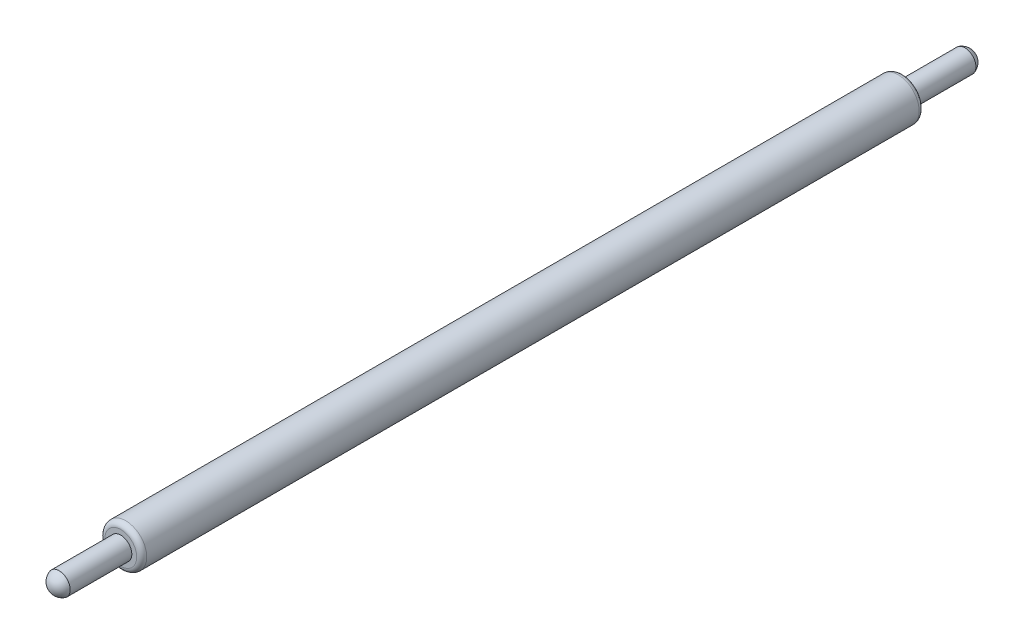
ISO-10303-21;
HEADER;
FILE_DESCRIPTION(('STEP AP214'),'2;1');
FILE_NAME('part.step','',(''),(''),'','','');
FILE_SCHEMA(('AUTOMOTIVE_DESIGN { 1 0 10303 214 1 1 1 1 }'));
ENDSEC;
DATA;
#1=APPLICATION_CONTEXT('core data for automotive mechanical design processes');
#2=APPLICATION_PROTOCOL_DEFINITION('international standard','automotive_design',2000,#1);
#3=PRODUCT_CONTEXT('',#1,'mechanical');
#4=PRODUCT('Part','Part','',(#3));
#5=PRODUCT_RELATED_PRODUCT_CATEGORY('part','',(#4));
#6=PRODUCT_DEFINITION_FORMATION('','',#4);
#7=PRODUCT_DEFINITION_CONTEXT('part definition',#1,'design');
#8=PRODUCT_DEFINITION('design','',#6,#7);
#9=PRODUCT_DEFINITION_SHAPE('','',#8);
#10=(LENGTH_UNIT() NAMED_UNIT(*) SI_UNIT(.MILLI.,.METRE.));
#11=(NAMED_UNIT(*) PLANE_ANGLE_UNIT() SI_UNIT($,.RADIAN.));
#12=(NAMED_UNIT(*) SI_UNIT($,.STERADIAN.) SOLID_ANGLE_UNIT());
#13=UNCERTAINTY_MEASURE_WITH_UNIT(LENGTH_MEASURE(1.E-05),#10,'distance_accuracy_value','');
#14=(GEOMETRIC_REPRESENTATION_CONTEXT(3) GLOBAL_UNCERTAINTY_ASSIGNED_CONTEXT((#13)) GLOBAL_UNIT_ASSIGNED_CONTEXT((#10,
#11,#12)) REPRESENTATION_CONTEXT('',''));
#15=CARTESIAN_POINT('',(0.,0.,0.));
#16=DIRECTION('',(0.,0.,1.));
#17=DIRECTION('',(1.,0.,0.));
#18=AXIS2_PLACEMENT_3D('',#15,#16,#17);
#19=CARTESIAN_POINT('',(0.,0.,13.4303214248775));
#20=DIRECTION('',(0.,0.,-1.));
#21=DIRECTION('',(-1.,0.,0.));
#22=AXIS2_PLACEMENT_3D('',#19,#20,#21);
#23=CYLINDRICAL_SURFACE('',#22,0.625);
#24=CARTESIAN_POINT('',(0.,0.,11.5125544719111));
#25=DIRECTION('',(0.,0.,1.));
#26=DIRECTION('',(0.,-1.,0.));
#27=AXIS2_PLACEMENT_3D('',#24,#25,#26);
#28=CIRCLE('',#27,0.625);
#29=CARTESIAN_POINT('',(0.,-0.625,11.5125544719111));
#30=VERTEX_POINT('',#29);
#31=EDGE_CURVE('E38',#30,#30,#28,.F.);
#32=ORIENTED_EDGE('',*,*,#31,.T.);
#33=EDGE_LOOP('',(#32));
#34=FACE_BOUND('',#33,.T.);
#35=CARTESIAN_POINT('',(0.,0.,-11.5125544719103));
#36=DIRECTION('',(0.,0.,-1.));
#37=DIRECTION('',(0.,1.,0.));
#38=AXIS2_PLACEMENT_3D('',#35,#36,#37);
#39=CIRCLE('',#38,0.625);
#40=CARTESIAN_POINT('',(0.,0.625,-11.5125544719103));
#41=VERTEX_POINT('',#40);
#42=EDGE_CURVE('E42',#41,#41,#39,.F.);
#43=ORIENTED_EDGE('',*,*,#42,.T.);
#44=EDGE_LOOP('',(#43));
#45=FACE_BOUND('',#44,.T.);
#46=ADVANCED_FACE('F31',(#34,#45),#23,.T.);
#47=CARTESIAN_POINT('',(-3.80092958100179,1.95882749862208,11.6625544719111));
#48=DIRECTION('',(0.,0.,1.));
#49=DIRECTION('',(0.,-1.,0.));
#50=AXIS2_PLACEMENT_3D('',#47,#48,#49);
#51=PLANE('',#50);
#52=CARTESIAN_POINT('',(0.,0.,11.6625544719111));
#53=DIRECTION('',(0.,0.,1.));
#54=DIRECTION('',(0.,-1.,0.));
#55=AXIS2_PLACEMENT_3D('',#52,#53,#54);
#56=CIRCLE('',#55,0.475);
#57=CARTESIAN_POINT('',(0.,-0.474999999999998,11.6625544719111));
#58=VERTEX_POINT('',#57);
#59=EDGE_CURVE('E46',#58,#58,#56,.T.);
#60=ORIENTED_EDGE('',*,*,#59,.T.);
#61=EDGE_LOOP('',(#60));
#62=FACE_BOUND('',#61,.T.);
#63=CARTESIAN_POINT('',(0.,0.,11.6625544719111));
#64=DIRECTION('',(0.,0.,1.));
#65=DIRECTION('',(1.,0.,0.));
#66=AXIS2_PLACEMENT_3D('',#63,#64,#65);
#67=CIRCLE('',#66,0.33);
#68=CARTESIAN_POINT('',(0.33,0.,11.6625544719111));
#69=VERTEX_POINT('',#68);
#70=EDGE_CURVE('E58',#69,#69,#67,.T.);
#71=ORIENTED_EDGE('',*,*,#70,.F.);
#72=EDGE_LOOP('',(#71));
#73=FACE_BOUND('',#72,.T.);
#74=ADVANCED_FACE('F70',(#62,#73),#51,.T.);
#75=CARTESIAN_POINT('',(-3.80092958100187,1.95882749862184,-11.6625544719103));
#76=DIRECTION('',(0.,0.,-1.));
#77=DIRECTION('',(0.,1.,0.));
#78=AXIS2_PLACEMENT_3D('',#75,#76,#77);
#79=PLANE('',#78);
#80=CARTESIAN_POINT('',(0.,0.,-11.6625544719103));
#81=DIRECTION('',(0.,0.,-1.));
#82=DIRECTION('',(0.,1.,0.));
#83=AXIS2_PLACEMENT_3D('',#80,#81,#82);
#84=CIRCLE('',#83,0.475);
#85=CARTESIAN_POINT('',(0.,0.474999999999998,-11.6625544719103));
#86=VERTEX_POINT('',#85);
#87=EDGE_CURVE('E10',#86,#86,#84,.T.);
#88=ORIENTED_EDGE('',*,*,#87,.T.);
#89=EDGE_LOOP('',(#88));
#90=FACE_BOUND('',#89,.T.);
#91=CARTESIAN_POINT('',(0.,-1.22158773905749E-13,-11.6625544719103));
#92=DIRECTION('',(0.,0.,-1.));
#93=DIRECTION('',(0.,1.,0.));
#94=AXIS2_PLACEMENT_3D('',#91,#92,#93);
#95=CIRCLE('',#94,0.33);
#96=CARTESIAN_POINT('',(0.,0.329999999999878,-11.6625544719103));
#97=VERTEX_POINT('',#96);
#98=EDGE_CURVE('E51',#97,#97,#95,.T.);
#99=ORIENTED_EDGE('',*,*,#98,.F.);
#100=EDGE_LOOP('',(#99));
#101=FACE_BOUND('',#100,.T.);
#102=ADVANCED_FACE('F67',(#90,#101),#79,.T.);
#103=CARTESIAN_POINT('',(0.,0.,14.4333809511667));
#104=DIRECTION('',(0.,0.,-1.));
#105=DIRECTION('',(-1.,0.,0.));
#106=AXIS2_PLACEMENT_3D('',#103,#104,#105);
#107=CYLINDRICAL_SURFACE('',#106,0.33);
#108=CARTESIAN_POINT('',(0.,0.,13.5000000000004));
#109=DIRECTION('',(0.,0.,-1.));
#110=DIRECTION('',(0.,1.,0.));
#111=AXIS2_PLACEMENT_3D('',#108,#109,#110);
#112=CIRCLE('',#111,0.33);
#113=CARTESIAN_POINT('',(0.,0.33,13.5000000000004));
#114=VERTEX_POINT('',#113);
#115=EDGE_CURVE('E55',#114,#114,#112,.T.);
#116=ORIENTED_EDGE('',*,*,#115,.T.);
#117=EDGE_LOOP('',(#116));
#118=FACE_BOUND('',#117,.T.);
#119=ORIENTED_EDGE('',*,*,#70,.T.);
#120=EDGE_LOOP('',(#119));
#121=FACE_BOUND('',#120,.T.);
#122=ADVANCED_FACE('F69',(#118,#121),#107,.T.);
#123=CARTESIAN_POINT('',(0.,0.,13.4072000000004));
#124=DIRECTION('',(0.,0.,1.));
#125=DIRECTION('',(1.,0.,0.));
#126=AXIS2_PLACEMENT_3D('',#123,#124,#125);
#127=SPHERICAL_SURFACE('',#126,0.3428);
#128=ORIENTED_EDGE('',*,*,#115,.F.);
#129=EDGE_LOOP('',(#128));
#130=FACE_BOUND('',#129,.T.);
#131=ADVANCED_FACE('F76',(#130),#127,.T.);
#132=CARTESIAN_POINT('',(0.,-1.51181640742228E-13,-14.4333809511658));
#133=DIRECTION('',(0.,0.,1.));
#134=DIRECTION('',(0.,-1.,0.));
#135=AXIS2_PLACEMENT_3D('',#132,#133,#134);
#136=CYLINDRICAL_SURFACE('',#135,0.33);
#137=ORIENTED_EDGE('',*,*,#98,.T.);
#138=EDGE_LOOP('',(#137));
#139=FACE_BOUND('',#138,.T.);
#140=CARTESIAN_POINT('',(0.,-1.41404994223142E-13,-13.4999999999996));
#141=DIRECTION('',(0.,0.,-1.));
#142=DIRECTION('',(0.,1.,0.));
#143=AXIS2_PLACEMENT_3D('',#140,#141,#142);
#144=CIRCLE('',#143,0.33);
#145=CARTESIAN_POINT('',(0.,0.329999999999859,-13.4999999999996));
#146=VERTEX_POINT('',#145);
#147=EDGE_CURVE('E52',#146,#146,#144,.T.);
#148=ORIENTED_EDGE('',*,*,#147,.F.);
#149=EDGE_LOOP('',(#148));
#150=FACE_BOUND('',#149,.T.);
#151=ADVANCED_FACE('F64',(#139,#150),#136,.T.);
#152=CARTESIAN_POINT('',(0.,-1.40432965818408E-13,-13.4071999999996));
#153=DIRECTION('',(0.,0.,1.));
#154=DIRECTION('',(1.,0.,0.));
#155=AXIS2_PLACEMENT_3D('',#152,#153,#154);
#156=SPHERICAL_SURFACE('',#155,0.3428);
#157=ORIENTED_EDGE('',*,*,#147,.T.);
#158=EDGE_LOOP('',(#157));
#159=FACE_BOUND('',#158,.T.);
#160=ADVANCED_FACE('F90',(#159),#156,.T.);
#161=CARTESIAN_POINT('',(0.,0.,11.5125544719111));
#162=DIRECTION('',(0.,0.,1.));
#163=DIRECTION('',(0.,-1.,0.));
#164=AXIS2_PLACEMENT_3D('',#161,#162,#163);
#165=TOROIDAL_SURFACE('',#164,0.475,0.15);
#166=ORIENTED_EDGE('',*,*,#31,.F.);
#167=EDGE_LOOP('',(#166));
#168=FACE_BOUND('',#167,.T.);
#169=ORIENTED_EDGE('',*,*,#59,.F.);
#170=EDGE_LOOP('',(#169));
#171=FACE_BOUND('',#170,.T.);
#172=ADVANCED_FACE('F92',(#168,#171),#165,.T.);
#173=CARTESIAN_POINT('',(0.,0.,-11.5125544719103));
#174=DIRECTION('',(0.,0.,-1.));
#175=DIRECTION('',(0.,1.,0.));
#176=AXIS2_PLACEMENT_3D('',#173,#174,#175);
#177=TOROIDAL_SURFACE('',#176,0.475,0.15);
#178=ORIENTED_EDGE('',*,*,#87,.F.);
#179=EDGE_LOOP('',(#178));
#180=FACE_BOUND('',#179,.T.);
#181=ORIENTED_EDGE('',*,*,#42,.F.);
#182=EDGE_LOOP('',(#181));
#183=FACE_BOUND('',#182,.T.);
#184=ADVANCED_FACE('F33',(#180,#183),#177,.T.);
#185=CLOSED_SHELL('',(#46,#74,#102,#122,#131,#151,#160,#172,#184));
#186=MANIFOLD_SOLID_BREP('B2',#185);
#187=ADVANCED_BREP_SHAPE_REPRESENTATION('',(#18,#186),#14);
#188=SHAPE_DEFINITION_REPRESENTATION(#9,#187);
ENDSEC;
END-ISO-10303-21;
